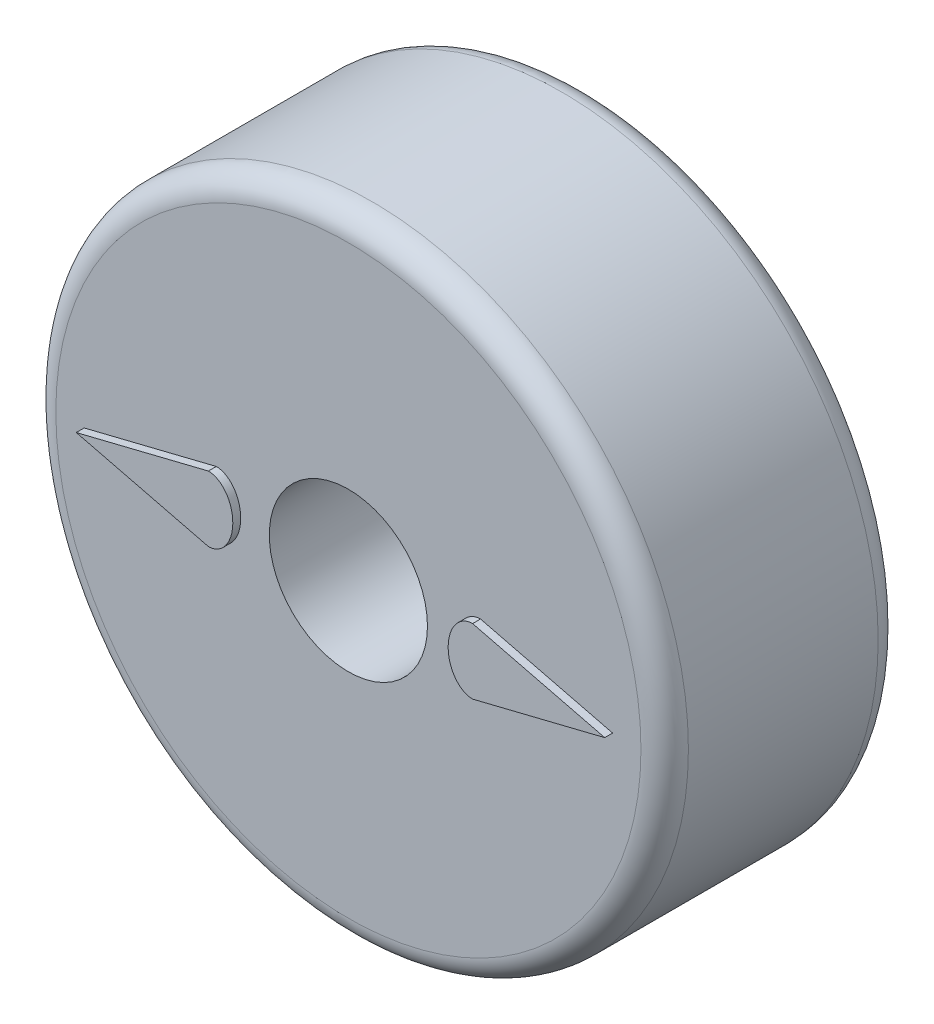
ISO-10303-21;
HEADER;
FILE_DESCRIPTION(('STEP AP214'),'2;1');
FILE_NAME('part.step','',(''),(''),'','','');
FILE_SCHEMA(('AUTOMOTIVE_DESIGN { 1 0 10303 214 1 1 1 1 }'));
ENDSEC;
DATA;
#1=APPLICATION_CONTEXT('core data for automotive mechanical design processes');
#2=APPLICATION_PROTOCOL_DEFINITION('international standard','automotive_design',2000,#1);
#3=PRODUCT_CONTEXT('',#1,'mechanical');
#4=PRODUCT('Part','Part','',(#3));
#5=PRODUCT_RELATED_PRODUCT_CATEGORY('part','',(#4));
#6=PRODUCT_DEFINITION_FORMATION('','',#4);
#7=PRODUCT_DEFINITION_CONTEXT('part definition',#1,'design');
#8=PRODUCT_DEFINITION('design','',#6,#7);
#9=PRODUCT_DEFINITION_SHAPE('','',#8);
#10=(LENGTH_UNIT() NAMED_UNIT(*) SI_UNIT(.MILLI.,.METRE.));
#11=(NAMED_UNIT(*) PLANE_ANGLE_UNIT() SI_UNIT($,.RADIAN.));
#12=(NAMED_UNIT(*) SI_UNIT($,.STERADIAN.) SOLID_ANGLE_UNIT());
#13=UNCERTAINTY_MEASURE_WITH_UNIT(LENGTH_MEASURE(1.E-05),#10,'distance_accuracy_value','');
#14=(GEOMETRIC_REPRESENTATION_CONTEXT(3) GLOBAL_UNCERTAINTY_ASSIGNED_CONTEXT((#13)) GLOBAL_UNIT_ASSIGNED_CONTEXT((#10,
#11,#12)) REPRESENTATION_CONTEXT('',''));
#15=CARTESIAN_POINT('',(0.,0.,0.));
#16=DIRECTION('',(0.,0.,1.));
#17=DIRECTION('',(1.,0.,0.));
#18=AXIS2_PLACEMENT_3D('',#15,#16,#17);
#19=CARTESIAN_POINT('',(0.,0.,76.2));
#20=DIRECTION('',(0.,0.,1.));
#21=DIRECTION('',(1.,0.,0.));
#22=AXIS2_PLACEMENT_3D('',#19,#20,#21);
#23=PLANE('',#22);
#24=DIRECTION('',(0.970705214057952,0.240273567836133,0.));
#25=VECTOR('',#24,1.);
#26=CARTESIAN_POINT('',(-4.89981550946711,19.7952546582466,76.2));
#27=LINE('',#26,#25);
#28=CARTESIAN_POINT('',(-84.8726443287811,0.,76.2));
#29=VERTEX_POINT('',#28);
#30=CARTESIAN_POINT('',(-42.4363221643905,10.5040401397009,76.2));
#31=VERTEX_POINT('',#30);
#32=EDGE_CURVE('E100',#29,#31,#27,.T.);
#33=ORIENTED_EDGE('',*,*,#32,.T.);
#34=CARTESIAN_POINT('',(-42.4363221643905,0.,76.2));
#35=DIRECTION('',(0.,0.,-1.));
#36=DIRECTION('',(0.,1.,0.));
#37=AXIS2_PLACEMENT_3D('',#34,#35,#36);
#38=ELLIPSE('',#37,10.5040401397009,7.84895347911389);
#39=CARTESIAN_POINT('',(-42.4363221643905,-10.5040401397009,76.2));
#40=VERTEX_POINT('',#39);
#41=EDGE_CURVE('E60',#31,#40,#38,.T.);
#42=ORIENTED_EDGE('',*,*,#41,.T.);
#43=DIRECTION('',(0.970705214057952,-0.240273567836133,0.));
#44=VECTOR('',#43,1.);
#45=CARTESIAN_POINT('',(-4.89981550946711,-19.7952546582466,76.2));
#46=LINE('',#45,#44);
#47=EDGE_CURVE('E56',#29,#40,#46,.T.);
#48=ORIENTED_EDGE('',*,*,#47,.F.);
#49=EDGE_LOOP('',(#33,#42,#48));
#50=FACE_BOUND('',#49,.T.);
#51=CARTESIAN_POINT('',(0.,0.,76.2));
#52=DIRECTION('',(0.,0.,1.));
#53=DIRECTION('',(1.,0.,0.));
#54=AXIS2_PLACEMENT_3D('',#51,#52,#53);
#55=CIRCLE('',#54,93.98);
#56=CARTESIAN_POINT('',(93.98,0.,76.2));
#57=VERTEX_POINT('',#56);
#58=EDGE_CURVE('E11',#57,#57,#55,.T.);
#59=ORIENTED_EDGE('',*,*,#58,.T.);
#60=EDGE_LOOP('',(#59));
#61=FACE_BOUND('',#60,.T.);
#62=CARTESIAN_POINT('',(0.,0.,76.2));
#63=DIRECTION('',(0.,0.,1.));
#64=DIRECTION('',(1.,0.,0.));
#65=AXIS2_PLACEMENT_3D('',#62,#63,#64);
#66=CIRCLE('',#65,25.4);
#67=CARTESIAN_POINT('',(25.4,0.,76.2));
#68=VERTEX_POINT('',#67);
#69=EDGE_CURVE('E170',#68,#68,#66,.T.);
#70=ORIENTED_EDGE('',*,*,#69,.F.);
#71=EDGE_LOOP('',(#70));
#72=FACE_BOUND('',#71,.T.);
#73=CARTESIAN_POINT('',(42.4363221643905,0.,76.2));
#74=DIRECTION('',(0.,0.,1.));
#75=DIRECTION('',(0.,1.,0.));
#76=AXIS2_PLACEMENT_3D('',#73,#74,#75);
#77=ELLIPSE('',#76,10.5040401397009,7.84895347911389);
#78=CARTESIAN_POINT('',(42.4363221643905,10.5040401397009,76.2));
#79=VERTEX_POINT('',#78);
#80=CARTESIAN_POINT('',(42.4363221643905,-10.5040401397009,76.2));
#81=VERTEX_POINT('',#80);
#82=EDGE_CURVE('E156',#79,#81,#77,.T.);
#83=ORIENTED_EDGE('',*,*,#82,.F.);
#84=DIRECTION('',(-0.970705214057952,0.240273567836133,0.));
#85=VECTOR('',#84,1.);
#86=CARTESIAN_POINT('',(4.89981550946711,19.7952546582466,76.2));
#87=LINE('',#86,#85);
#88=CARTESIAN_POINT('',(84.8726443287811,0.,76.2));
#89=VERTEX_POINT('',#88);
#90=EDGE_CURVE('E102',#89,#79,#87,.T.);
#91=ORIENTED_EDGE('',*,*,#90,.F.);
#92=DIRECTION('',(-0.970705214057952,-0.240273567836133,0.));
#93=VECTOR('',#92,1.);
#94=CARTESIAN_POINT('',(4.89981550946711,-19.7952546582466,76.2));
#95=LINE('',#94,#93);
#96=EDGE_CURVE('E159',#89,#81,#95,.T.);
#97=ORIENTED_EDGE('',*,*,#96,.T.);
#98=EDGE_LOOP('',(#83,#91,#97));
#99=FACE_BOUND('',#98,.T.);
#100=ADVANCED_FACE('F41',(#50,#61,#72,#99),#23,.T.);
#101=CARTESIAN_POINT('',(0.,0.,0.));
#102=DIRECTION('',(0.,0.,1.));
#103=DIRECTION('',(1.,0.,0.));
#104=AXIS2_PLACEMENT_3D('',#101,#102,#103);
#105=PLANE('',#104);
#106=CARTESIAN_POINT('',(0.,0.,0.));
#107=DIRECTION('',(0.,0.,1.));
#108=DIRECTION('',(1.,0.,0.));
#109=AXIS2_PLACEMENT_3D('',#106,#107,#108);
#110=CIRCLE('',#109,93.98);
#111=CARTESIAN_POINT('',(93.98,0.,0.));
#112=VERTEX_POINT('',#111);
#113=EDGE_CURVE('E49',#112,#112,#110,.F.);
#114=ORIENTED_EDGE('',*,*,#113,.T.);
#115=EDGE_LOOP('',(#114));
#116=FACE_BOUND('',#115,.T.);
#117=CARTESIAN_POINT('',(0.,0.,0.));
#118=DIRECTION('',(0.,0.,1.));
#119=DIRECTION('',(1.,0.,0.));
#120=AXIS2_PLACEMENT_3D('',#117,#118,#119);
#121=CIRCLE('',#120,25.4);
#122=CARTESIAN_POINT('',(25.4,0.,0.));
#123=VERTEX_POINT('',#122);
#124=EDGE_CURVE('E169',#123,#123,#121,.T.);
#125=ORIENTED_EDGE('',*,*,#124,.T.);
#126=EDGE_LOOP('',(#125));
#127=FACE_BOUND('',#126,.T.);
#128=ADVANCED_FACE('F183',(#116,#127),#105,.F.);
#129=CARTESIAN_POINT('',(0.,0.,76.2));
#130=DIRECTION('',(0.,0.,-1.));
#131=DIRECTION('',(-1.,0.,0.));
#132=AXIS2_PLACEMENT_3D('',#129,#130,#131);
#133=CYLINDRICAL_SURFACE('',#132,101.6);
#134=CARTESIAN_POINT('',(0.,0.,7.62));
#135=DIRECTION('',(0.,0.,1.));
#136=DIRECTION('',(1.,0.,0.));
#137=AXIS2_PLACEMENT_3D('',#134,#135,#136);
#138=CIRCLE('',#137,101.6);
#139=CARTESIAN_POINT('',(101.6,0.,7.62));
#140=VERTEX_POINT('',#139);
#141=EDGE_CURVE('E178',#140,#140,#138,.T.);
#142=ORIENTED_EDGE('',*,*,#141,.T.);
#143=EDGE_LOOP('',(#142));
#144=FACE_BOUND('',#143,.T.);
#145=CARTESIAN_POINT('',(0.,0.,68.58));
#146=DIRECTION('',(0.,0.,1.));
#147=DIRECTION('',(1.,0.,0.));
#148=AXIS2_PLACEMENT_3D('',#145,#146,#147);
#149=CIRCLE('',#148,101.6);
#150=CARTESIAN_POINT('',(101.6,0.,68.58));
#151=VERTEX_POINT('',#150);
#152=EDGE_CURVE('E173',#151,#151,#149,.F.);
#153=ORIENTED_EDGE('',*,*,#152,.T.);
#154=EDGE_LOOP('',(#153));
#155=FACE_BOUND('',#154,.T.);
#156=ADVANCED_FACE('F192',(#144,#155),#133,.T.);
#157=CARTESIAN_POINT('',(0.,0.,76.2));
#158=DIRECTION('',(0.,0.,-1.));
#159=DIRECTION('',(-1.,0.,0.));
#160=AXIS2_PLACEMENT_3D('',#157,#158,#159);
#161=CYLINDRICAL_SURFACE('',#160,25.4);
#162=ORIENTED_EDGE('',*,*,#69,.T.);
#163=EDGE_LOOP('',(#162));
#164=FACE_BOUND('',#163,.T.);
#165=ORIENTED_EDGE('',*,*,#124,.F.);
#166=EDGE_LOOP('',(#165));
#167=FACE_BOUND('',#166,.T.);
#168=ADVANCED_FACE('F189',(#164,#167),#161,.F.);
#169=CARTESIAN_POINT('',(0.,0.,7.62));
#170=DIRECTION('',(0.,0.,1.));
#171=DIRECTION('',(1.,0.,0.));
#172=AXIS2_PLACEMENT_3D('',#169,#170,#171);
#173=TOROIDAL_SURFACE('',#172,93.98,7.62);
#174=ORIENTED_EDGE('',*,*,#113,.F.);
#175=EDGE_LOOP('',(#174));
#176=FACE_BOUND('',#175,.T.);
#177=ORIENTED_EDGE('',*,*,#141,.F.);
#178=EDGE_LOOP('',(#177));
#179=FACE_BOUND('',#178,.T.);
#180=ADVANCED_FACE('F186',(#176,#179),#173,.T.);
#181=CARTESIAN_POINT('',(0.,0.,68.58));
#182=DIRECTION('',(0.,0.,1.));
#183=DIRECTION('',(1.,0.,0.));
#184=AXIS2_PLACEMENT_3D('',#181,#182,#183);
#185=TOROIDAL_SURFACE('',#184,93.98,7.62);
#186=ORIENTED_EDGE('',*,*,#152,.F.);
#187=EDGE_LOOP('',(#186));
#188=FACE_BOUND('',#187,.T.);
#189=ORIENTED_EDGE('',*,*,#58,.F.);
#190=EDGE_LOOP('',(#189));
#191=FACE_BOUND('',#190,.T.);
#192=ADVANCED_FACE('F43',(#188,#191),#185,.T.);
#193=CARTESIAN_POINT('',(4.89981550946711,19.7952546582466,78.74));
#194=DIRECTION('',(-0.240273567836133,-0.970705214057952,0.));
#195=DIRECTION('',(0.970705214057953,-0.240273567836133,0.));
#196=AXIS2_PLACEMENT_3D('',#193,#194,#195);
#197=PLANE('',#196);
#198=ORIENTED_EDGE('',*,*,#90,.T.);
#199=DIRECTION('',(0.,0.,-1.));
#200=VECTOR('',#199,1.);
#201=CARTESIAN_POINT('',(42.4363221643905,10.5040401397009,78.74));
#202=LINE('',#201,#200);
#203=CARTESIAN_POINT('',(42.4363221643905,10.5040401397009,78.74));
#204=VERTEX_POINT('',#203);
#205=EDGE_CURVE('E166',#204,#79,#202,.T.);
#206=ORIENTED_EDGE('',*,*,#205,.F.);
#207=DIRECTION('',(-0.970705214057952,0.240273567836133,0.));
#208=VECTOR('',#207,1.);
#209=CARTESIAN_POINT('',(4.89981550946711,19.7952546582466,78.74));
#210=LINE('',#209,#208);
#211=CARTESIAN_POINT('',(84.8726443287811,0.,78.74));
#212=VERTEX_POINT('',#211);
#213=EDGE_CURVE('E150',#212,#204,#210,.T.);
#214=ORIENTED_EDGE('',*,*,#213,.F.);
#215=DIRECTION('',(0.,0.,-1.));
#216=VECTOR('',#215,1.);
#217=CARTESIAN_POINT('',(84.8726443287811,0.,78.74));
#218=LINE('',#217,#216);
#219=EDGE_CURVE('E153',#212,#89,#218,.T.);
#220=ORIENTED_EDGE('',*,*,#219,.T.);
#221=EDGE_LOOP('',(#198,#206,#214,#220));
#222=FACE_BOUND('',#221,.T.);
#223=ADVANCED_FACE('F142',(#222),#197,.F.);
#224=CARTESIAN_POINT('',(42.4363221643905,0.,78.74));
#225=DIRECTION('',(0.,0.,1.));
#226=DIRECTION('',(0.,1.,0.));
#227=AXIS2_PLACEMENT_3D('',#224,#225,#226);
#228=ELLIPSE('',#227,10.5040401397009,7.84895347911389);
#229=DIRECTION('',(0.,0.,-1.));
#230=VECTOR('',#229,1.);
#231=SURFACE_OF_LINEAR_EXTRUSION('',#228,#230);
#232=ORIENTED_EDGE('',*,*,#82,.T.);
#233=DIRECTION('',(0.,0.,-1.));
#234=VECTOR('',#233,1.);
#235=CARTESIAN_POINT('',(42.4363221643905,-10.5040401397009,78.74));
#236=LINE('',#235,#234);
#237=CARTESIAN_POINT('',(42.4363221643905,-10.5040401397009,78.74));
#238=VERTEX_POINT('',#237);
#239=EDGE_CURVE('E163',#238,#81,#236,.T.);
#240=ORIENTED_EDGE('',*,*,#239,.F.);
#241=EDGE_CURVE('E145',#204,#238,#228,.T.);
#242=ORIENTED_EDGE('',*,*,#241,.F.);
#243=ORIENTED_EDGE('',*,*,#205,.T.);
#244=EDGE_LOOP('',(#232,#240,#242,#243));
#245=FACE_BOUND('',#244,.T.);
#246=ADVANCED_FACE('F137',(#245),#231,.F.);
#247=CARTESIAN_POINT('',(4.89981550946711,-19.7952546582466,78.74));
#248=DIRECTION('',(0.240273567836133,-0.970705214057952,0.));
#249=DIRECTION('',(0.970705214057953,0.240273567836133,0.));
#250=AXIS2_PLACEMENT_3D('',#247,#248,#249);
#251=PLANE('',#250);
#252=ORIENTED_EDGE('',*,*,#96,.F.);
#253=ORIENTED_EDGE('',*,*,#219,.F.);
#254=DIRECTION('',(-0.970705214057952,-0.240273567836133,0.));
#255=VECTOR('',#254,1.);
#256=CARTESIAN_POINT('',(4.89981550946711,-19.7952546582466,78.74));
#257=LINE('',#256,#255);
#258=EDGE_CURVE('E149',#212,#238,#257,.T.);
#259=ORIENTED_EDGE('',*,*,#258,.T.);
#260=ORIENTED_EDGE('',*,*,#239,.T.);
#261=EDGE_LOOP('',(#252,#253,#259,#260));
#262=FACE_BOUND('',#261,.T.);
#263=ADVANCED_FACE('F133',(#262),#251,.T.);
#264=CARTESIAN_POINT('',(0.,0.,78.74));
#265=DIRECTION('',(0.,0.,1.));
#266=DIRECTION('',(1.,0.,0.));
#267=AXIS2_PLACEMENT_3D('',#264,#265,#266);
#268=PLANE('',#267);
#269=ORIENTED_EDGE('',*,*,#213,.T.);
#270=ORIENTED_EDGE('',*,*,#241,.T.);
#271=ORIENTED_EDGE('',*,*,#258,.F.);
#272=EDGE_LOOP('',(#269,#270,#271));
#273=FACE_BOUND('',#272,.T.);
#274=ADVANCED_FACE('F130',(#273),#268,.T.);
#275=CARTESIAN_POINT('',(-4.89981550946711,19.7952546582466,78.74));
#276=DIRECTION('',(-0.240273567836133,0.970705214057952,0.));
#277=DIRECTION('',(-0.970705214057953,-0.240273567836133,0.));
#278=AXIS2_PLACEMENT_3D('',#275,#276,#277);
#279=PLANE('',#278);
#280=ORIENTED_EDGE('',*,*,#32,.F.);
#281=DIRECTION('',(0.,0.,-1.));
#282=VECTOR('',#281,1.);
#283=CARTESIAN_POINT('',(-84.8726443287811,0.,78.74));
#284=LINE('',#283,#282);
#285=CARTESIAN_POINT('',(-84.8726443287811,0.,78.74));
#286=VERTEX_POINT('',#285);
#287=EDGE_CURVE('E93',#286,#29,#284,.T.);
#288=ORIENTED_EDGE('',*,*,#287,.F.);
#289=DIRECTION('',(0.970705214057952,0.240273567836133,0.));
#290=VECTOR('',#289,1.);
#291=CARTESIAN_POINT('',(-4.89981550946711,19.7952546582466,78.74));
#292=LINE('',#291,#290);
#293=CARTESIAN_POINT('',(-42.4363221643905,10.5040401397009,78.74));
#294=VERTEX_POINT('',#293);
#295=EDGE_CURVE('E98',#286,#294,#292,.T.);
#296=ORIENTED_EDGE('',*,*,#295,.T.);
#297=DIRECTION('',(0.,0.,-1.));
#298=VECTOR('',#297,1.);
#299=CARTESIAN_POINT('',(-42.4363221643905,10.5040401397009,78.74));
#300=LINE('',#299,#298);
#301=EDGE_CURVE('E118',#294,#31,#300,.T.);
#302=ORIENTED_EDGE('',*,*,#301,.T.);
#303=EDGE_LOOP('',(#280,#288,#296,#302));
#304=FACE_BOUND('',#303,.T.);
#305=ADVANCED_FACE('F95',(#304),#279,.T.);
#306=CARTESIAN_POINT('',(-4.89981550946711,-19.7952546582466,78.74));
#307=DIRECTION('',(0.240273567836133,0.970705214057952,0.));
#308=DIRECTION('',(-0.970705214057953,0.240273567836133,0.));
#309=AXIS2_PLACEMENT_3D('',#306,#307,#308);
#310=PLANE('',#309);
#311=ORIENTED_EDGE('',*,*,#47,.T.);
#312=DIRECTION('',(0.,0.,-1.));
#313=VECTOR('',#312,1.);
#314=CARTESIAN_POINT('',(-42.4363221643905,-10.5040401397009,78.74));
#315=LINE('',#314,#313);
#316=CARTESIAN_POINT('',(-42.4363221643905,-10.5040401397009,78.74));
#317=VERTEX_POINT('',#316);
#318=EDGE_CURVE('E103',#317,#40,#315,.T.);
#319=ORIENTED_EDGE('',*,*,#318,.F.);
#320=DIRECTION('',(0.970705214057952,-0.240273567836133,0.));
#321=VECTOR('',#320,1.);
#322=CARTESIAN_POINT('',(-4.89981550946711,-19.7952546582466,78.74));
#323=LINE('',#322,#321);
#324=EDGE_CURVE('E106',#286,#317,#323,.T.);
#325=ORIENTED_EDGE('',*,*,#324,.F.);
#326=ORIENTED_EDGE('',*,*,#287,.T.);
#327=EDGE_LOOP('',(#311,#319,#325,#326));
#328=FACE_BOUND('',#327,.T.);
#329=ADVANCED_FACE('F107',(#328),#310,.F.);
#330=CARTESIAN_POINT('',(-42.4363221643905,0.,78.74));
#331=DIRECTION('',(0.,0.,-1.));
#332=DIRECTION('',(0.,1.,0.));
#333=AXIS2_PLACEMENT_3D('',#330,#331,#332);
#334=ELLIPSE('',#333,10.5040401397009,7.84895347911389);
#335=DIRECTION('',(0.,0.,-1.));
#336=VECTOR('',#335,1.);
#337=SURFACE_OF_LINEAR_EXTRUSION('',#334,#336);
#338=ORIENTED_EDGE('',*,*,#41,.F.);
#339=ORIENTED_EDGE('',*,*,#301,.F.);
#340=EDGE_CURVE('E110',#294,#317,#334,.T.);
#341=ORIENTED_EDGE('',*,*,#340,.T.);
#342=ORIENTED_EDGE('',*,*,#318,.T.);
#343=EDGE_LOOP('',(#338,#339,#341,#342));
#344=FACE_BOUND('',#343,.T.);
#345=ADVANCED_FACE('F121',(#344),#337,.T.);
#346=CARTESIAN_POINT('',(0.,0.,78.74));
#347=DIRECTION('',(0.,0.,1.));
#348=DIRECTION('',(-1.,0.,0.));
#349=AXIS2_PLACEMENT_3D('',#346,#347,#348);
#350=PLANE('',#349);
#351=ORIENTED_EDGE('',*,*,#295,.F.);
#352=ORIENTED_EDGE('',*,*,#324,.T.);
#353=ORIENTED_EDGE('',*,*,#340,.F.);
#354=EDGE_LOOP('',(#351,#352,#353));
#355=FACE_BOUND('',#354,.T.);
#356=ADVANCED_FACE('F112',(#355),#350,.T.);
#357=CLOSED_SHELL('',(#100,#128,#156,#168,#180,#192,#223,#246,#263,#274,#305,#329,#345,#356));
#358=MANIFOLD_SOLID_BREP('B2',#357);
#359=ADVANCED_BREP_SHAPE_REPRESENTATION('',(#18,#358),#14);
#360=SHAPE_DEFINITION_REPRESENTATION(#9,#359);
ENDSEC;
END-ISO-10303-21;
